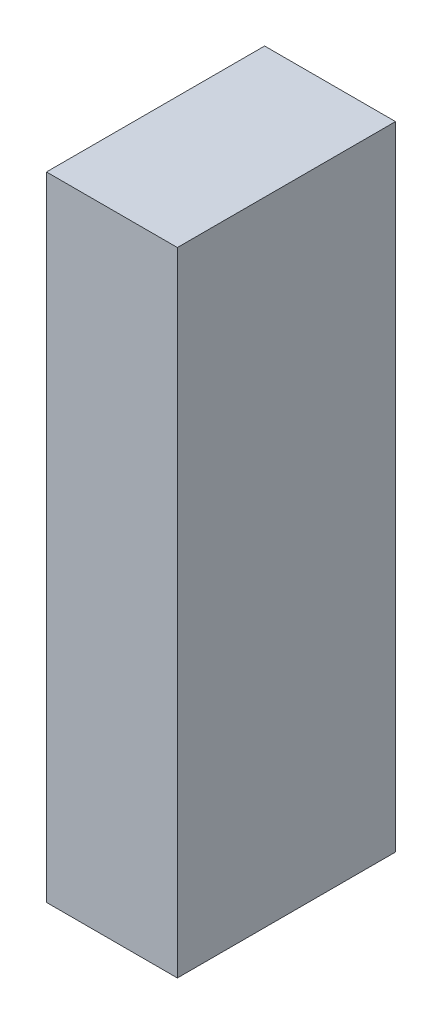
ISO-10303-21;
HEADER;
FILE_DESCRIPTION(('STEP AP214'),'2;1');
FILE_NAME('part.step','',(''),(''),'','','');
FILE_SCHEMA(('AUTOMOTIVE_DESIGN { 1 0 10303 214 1 1 1 1 }'));
ENDSEC;
DATA;
#1=APPLICATION_CONTEXT('core data for automotive mechanical design processes');
#2=APPLICATION_PROTOCOL_DEFINITION('international standard','automotive_design',2000,#1);
#3=PRODUCT_CONTEXT('',#1,'mechanical');
#4=PRODUCT('Part','Part','',(#3));
#5=PRODUCT_RELATED_PRODUCT_CATEGORY('part','',(#4));
#6=PRODUCT_DEFINITION_FORMATION('','',#4);
#7=PRODUCT_DEFINITION_CONTEXT('part definition',#1,'design');
#8=PRODUCT_DEFINITION('design','',#6,#7);
#9=PRODUCT_DEFINITION_SHAPE('','',#8);
#10=(LENGTH_UNIT() NAMED_UNIT(*) SI_UNIT(.MILLI.,.METRE.));
#11=(NAMED_UNIT(*) PLANE_ANGLE_UNIT() SI_UNIT($,.RADIAN.));
#12=(NAMED_UNIT(*) SI_UNIT($,.STERADIAN.) SOLID_ANGLE_UNIT());
#13=UNCERTAINTY_MEASURE_WITH_UNIT(LENGTH_MEASURE(1.E-05),#10,'distance_accuracy_value','');
#14=(GEOMETRIC_REPRESENTATION_CONTEXT(3) GLOBAL_UNCERTAINTY_ASSIGNED_CONTEXT((#13)) GLOBAL_UNIT_ASSIGNED_CONTEXT((#10,
#11,#12)) REPRESENTATION_CONTEXT('',''));
#15=CARTESIAN_POINT('',(0.,0.,0.));
#16=DIRECTION('',(0.,0.,1.));
#17=DIRECTION('',(1.,0.,0.));
#18=AXIS2_PLACEMENT_3D('',#15,#16,#17);
#19=CARTESIAN_POINT('',(0.799977413699082,-0.725004801815871,-2.64111989736557));
#20=DIRECTION('',(-8.74227765734759E-08,-1.,0.));
#21=DIRECTION('',(1.,-8.74227765734759E-08,0.));
#22=AXIS2_PLACEMENT_3D('',#19,#20,#21);
#23=PLANE('',#22);
#24=DIRECTION('',(0.999999999999996,-8.74227766645429E-08,0.));
#25=VECTOR('',#24,1.);
#26=CARTESIAN_POINT('',(0.799977413699082,-0.725004801815871,-2.64111989736557));
#27=LINE('',#26,#25);
#28=CARTESIAN_POINT('',(0.799977413699082,-0.725004801815871,-2.64111989736557));
#29=VERTEX_POINT('',#28);
#30=CARTESIAN_POINT('',(1.09999572424596,-0.725004828044305,-2.64111989736557));
#31=VERTEX_POINT('',#30);
#32=EDGE_CURVE('E11',#29,#31,#27,.T.);
#33=ORIENTED_EDGE('',*,*,#32,.T.);
#34=DIRECTION('',(0.,0.,1.));
#35=VECTOR('',#34,1.);
#36=CARTESIAN_POINT('',(1.09999572424596,-0.725004828044305,-2.64111989736557));
#37=LINE('',#36,#35);
#38=CARTESIAN_POINT('',(1.09999572424596,-0.725004828044305,-2.14112091064453));
#39=VERTEX_POINT('',#38);
#40=EDGE_CURVE('E88',#31,#39,#37,.T.);
#41=ORIENTED_EDGE('',*,*,#40,.T.);
#42=DIRECTION('',(0.999999999999996,-8.74227766645429E-08,0.));
#43=VECTOR('',#42,1.);
#44=CARTESIAN_POINT('',(0.799977413699082,-0.725004801815871,-2.14112091064453));
#45=LINE('',#44,#43);
#46=CARTESIAN_POINT('',(0.799977413699082,-0.725004801815871,-2.14112091064453));
#47=VERTEX_POINT('',#46);
#48=EDGE_CURVE('E83',#47,#39,#45,.T.);
#49=ORIENTED_EDGE('',*,*,#48,.F.);
#50=DIRECTION('',(0.,0.,1.));
#51=VECTOR('',#50,1.);
#52=CARTESIAN_POINT('',(0.799977413699095,-0.725004801815871,-2.64111989736557));
#53=LINE('',#52,#51);
#54=EDGE_CURVE('E72',#29,#47,#53,.T.);
#55=ORIENTED_EDGE('',*,*,#54,.F.);
#56=EDGE_LOOP('',(#33,#41,#49,#55));
#57=FACE_BOUND('',#56,.T.);
#58=ADVANCED_FACE('F17',(#57),#23,.T.);
#59=CARTESIAN_POINT('',(1.09999572424596,-0.725004828044305,-2.64111989736557));
#60=DIRECTION('',(1.,-8.74227765734759E-08,0.));
#61=DIRECTION('',(8.74227765734759E-08,1.,0.));
#62=AXIS2_PLACEMENT_3D('',#59,#60,#61);
#63=PLANE('',#62);
#64=DIRECTION('',(8.74227765590445E-08,0.999999999999996,0.));
#65=VECTOR('',#64,1.);
#66=CARTESIAN_POINT('',(1.09999572424596,-0.725004828044305,-2.64111989736557));
#67=LINE('',#66,#65);
#68=CARTESIAN_POINT('',(1.0999958510094,0.724999749592413,-2.64111989736557));
#69=VERTEX_POINT('',#68);
#70=EDGE_CURVE('E24',#31,#69,#67,.T.);
#71=ORIENTED_EDGE('',*,*,#70,.T.);
#72=DIRECTION('',(0.,0.,1.));
#73=VECTOR('',#72,1.);
#74=CARTESIAN_POINT('',(1.09999585100938,0.724999749592413,-2.64111989736557));
#75=LINE('',#74,#73);
#76=CARTESIAN_POINT('',(1.0999958510094,0.724999749592413,-2.14112091064453));
#77=VERTEX_POINT('',#76);
#78=EDGE_CURVE('E85',#69,#77,#75,.T.);
#79=ORIENTED_EDGE('',*,*,#78,.T.);
#80=DIRECTION('',(8.74227765590445E-08,0.999999999999996,0.));
#81=VECTOR('',#80,1.);
#82=CARTESIAN_POINT('',(1.09999572424596,-0.725004828044305,-2.14112091064453));
#83=LINE('',#82,#81);
#84=EDGE_CURVE('E66',#39,#77,#83,.T.);
#85=ORIENTED_EDGE('',*,*,#84,.F.);
#86=ORIENTED_EDGE('',*,*,#40,.F.);
#87=EDGE_LOOP('',(#71,#79,#85,#86));
#88=FACE_BOUND('',#87,.T.);
#89=ADVANCED_FACE('F89',(#88),#63,.T.);
#90=CARTESIAN_POINT('',(1.0999958510094,0.724999749592413,-2.64111989736557));
#91=DIRECTION('',(8.74227765734759E-08,1.,0.));
#92=DIRECTION('',(-1.,8.74227765734759E-08,0.));
#93=AXIS2_PLACEMENT_3D('',#90,#91,#92);
#94=PLANE('',#93);
#95=DIRECTION('',(-0.999999999999996,8.74227766645429E-08,0.));
#96=VECTOR('',#95,1.);
#97=CARTESIAN_POINT('',(1.0999958510094,0.724999749592413,-2.64111989736557));
#98=LINE('',#97,#96);
#99=CARTESIAN_POINT('',(0.799977540462521,0.724999775820848,-2.64111989736557));
#100=VERTEX_POINT('',#99);
#101=EDGE_CURVE('E62',#69,#100,#98,.T.);
#102=ORIENTED_EDGE('',*,*,#101,.T.);
#103=DIRECTION('',(0.,0.,1.));
#104=VECTOR('',#103,1.);
#105=CARTESIAN_POINT('',(0.799977540462521,0.724999775820847,-2.64111989736557));
#106=LINE('',#105,#104);
#107=CARTESIAN_POINT('',(0.799977540462521,0.724999775820848,-2.14112091064453));
#108=VERTEX_POINT('',#107);
#109=EDGE_CURVE('E55',#100,#108,#106,.T.);
#110=ORIENTED_EDGE('',*,*,#109,.T.);
#111=DIRECTION('',(-0.999999999999996,8.74227766645429E-08,0.));
#112=VECTOR('',#111,1.);
#113=CARTESIAN_POINT('',(1.0999958510094,0.724999749592413,-2.14112091064453));
#114=LINE('',#113,#112);
#115=EDGE_CURVE('E59',#77,#108,#114,.T.);
#116=ORIENTED_EDGE('',*,*,#115,.F.);
#117=ORIENTED_EDGE('',*,*,#78,.F.);
#118=EDGE_LOOP('',(#102,#110,#116,#117));
#119=FACE_BOUND('',#118,.T.);
#120=ADVANCED_FACE('F57',(#119),#94,.T.);
#121=CARTESIAN_POINT('',(0.799977540462521,0.724999775820848,-2.64111989736557));
#122=DIRECTION('',(-1.,8.74227765734759E-08,0.));
#123=DIRECTION('',(-8.74227765734759E-08,-1.,0.));
#124=AXIS2_PLACEMENT_3D('',#121,#122,#123);
#125=PLANE('',#124);
#126=DIRECTION('',(-8.74227765590445E-08,-0.999999999999996,0.));
#127=VECTOR('',#126,1.);
#128=CARTESIAN_POINT('',(0.799977540462521,0.724999775820848,-2.64111989736557));
#129=LINE('',#128,#127);
#130=EDGE_CURVE('E65',#100,#29,#129,.T.);
#131=ORIENTED_EDGE('',*,*,#130,.T.);
#132=ORIENTED_EDGE('',*,*,#54,.T.);
#133=DIRECTION('',(-8.74227765590445E-08,-0.999999999999996,0.));
#134=VECTOR('',#133,1.);
#135=CARTESIAN_POINT('',(0.799977540462521,0.724999775820848,-2.14112091064453));
#136=LINE('',#135,#134);
#137=EDGE_CURVE('E70',#108,#47,#136,.T.);
#138=ORIENTED_EDGE('',*,*,#137,.F.);
#139=ORIENTED_EDGE('',*,*,#109,.F.);
#140=EDGE_LOOP('',(#131,#132,#138,#139));
#141=FACE_BOUND('',#140,.T.);
#142=ADVANCED_FACE('F71',(#141),#125,.T.);
#143=CARTESIAN_POINT('',(277.5,117.999977111816,-2.14112091064453));
#144=DIRECTION('',(0.,0.,1.));
#145=DIRECTION('',(-1.,8.74227765734759E-08,0.));
#146=AXIS2_PLACEMENT_3D('',#143,#144,#145);
#147=PLANE('',#146);
#148=ORIENTED_EDGE('',*,*,#48,.T.);
#149=ORIENTED_EDGE('',*,*,#84,.T.);
#150=ORIENTED_EDGE('',*,*,#115,.T.);
#151=ORIENTED_EDGE('',*,*,#137,.T.);
#152=EDGE_LOOP('',(#148,#149,#150,#151));
#153=FACE_BOUND('',#152,.T.);
#154=ADVANCED_FACE('F76',(#153),#147,.T.);
#155=CARTESIAN_POINT('',(277.5,117.999977111816,-2.64111989736557));
#156=DIRECTION('',(0.,0.,1.));
#157=DIRECTION('',(-1.,8.74227765734759E-08,0.));
#158=AXIS2_PLACEMENT_3D('',#155,#156,#157);
#159=PLANE('',#158);
#160=ORIENTED_EDGE('',*,*,#130,.F.);
#161=ORIENTED_EDGE('',*,*,#101,.F.);
#162=ORIENTED_EDGE('',*,*,#70,.F.);
#163=ORIENTED_EDGE('',*,*,#32,.F.);
#164=EDGE_LOOP('',(#160,#161,#162,#163));
#165=FACE_BOUND('',#164,.T.);
#166=ADVANCED_FACE('F91',(#165),#159,.F.);
#167=CLOSED_SHELL('',(#58,#89,#120,#142,#154,#166));
#168=MANIFOLD_SOLID_BREP('B1',#167);
#169=ADVANCED_BREP_SHAPE_REPRESENTATION('',(#18,#168),#14);
#170=SHAPE_DEFINITION_REPRESENTATION(#9,#169);
ENDSEC;
END-ISO-10303-21;
